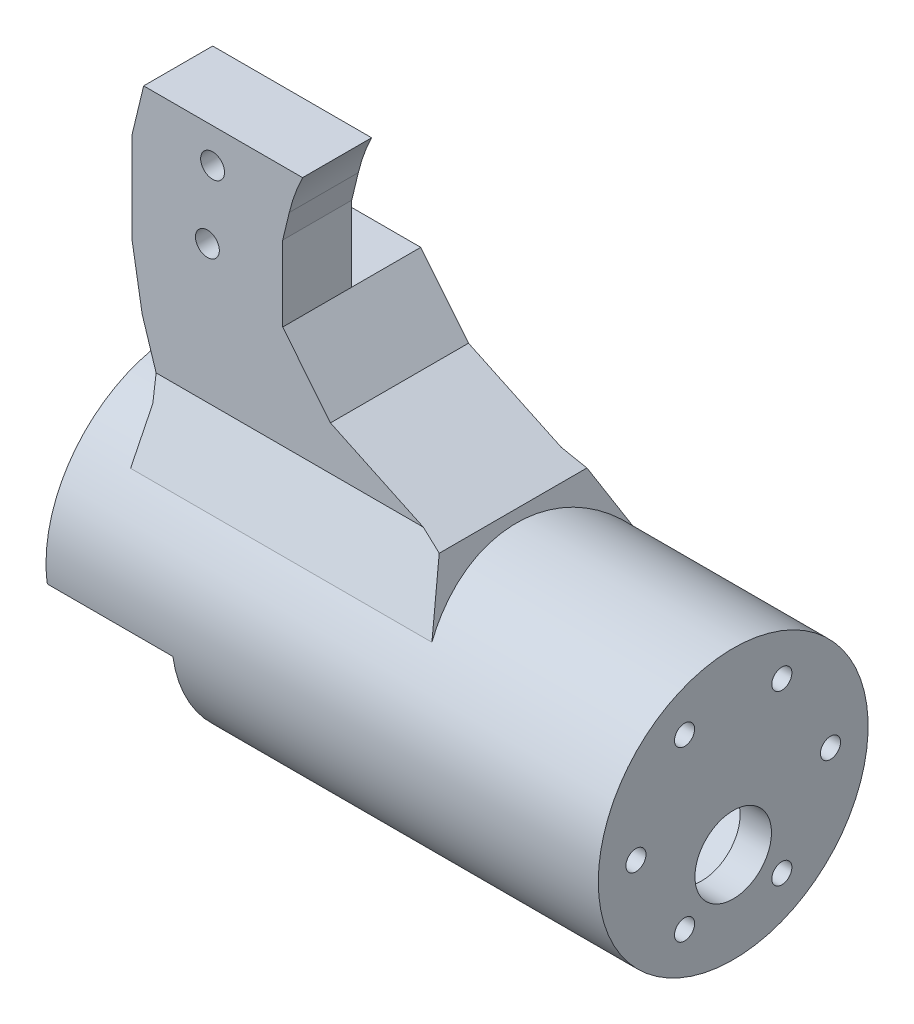
ISO-10303-21;
HEADER;
FILE_DESCRIPTION(('STEP AP214'),'2;1');
FILE_NAME('part.step','',(''),(''),'','','');
FILE_SCHEMA(('AUTOMOTIVE_DESIGN { 1 0 10303 214 1 1 1 1 }'));
ENDSEC;
DATA;
#1=APPLICATION_CONTEXT('core data for automotive mechanical design processes');
#2=APPLICATION_PROTOCOL_DEFINITION('international standard','automotive_design',2000,#1);
#3=PRODUCT_CONTEXT('',#1,'mechanical');
#4=PRODUCT('Part','Part','',(#3));
#5=PRODUCT_RELATED_PRODUCT_CATEGORY('part','',(#4));
#6=PRODUCT_DEFINITION_FORMATION('','',#4);
#7=PRODUCT_DEFINITION_CONTEXT('part definition',#1,'design');
#8=PRODUCT_DEFINITION('design','',#6,#7);
#9=PRODUCT_DEFINITION_SHAPE('','',#8);
#10=(LENGTH_UNIT() NAMED_UNIT(*) SI_UNIT(.MILLI.,.METRE.));
#11=(NAMED_UNIT(*) PLANE_ANGLE_UNIT() SI_UNIT($,.RADIAN.));
#12=(NAMED_UNIT(*) SI_UNIT($,.STERADIAN.) SOLID_ANGLE_UNIT());
#13=UNCERTAINTY_MEASURE_WITH_UNIT(LENGTH_MEASURE(1.E-05),#10,'distance_accuracy_value','');
#14=(GEOMETRIC_REPRESENTATION_CONTEXT(3) GLOBAL_UNCERTAINTY_ASSIGNED_CONTEXT((#13)) GLOBAL_UNIT_ASSIGNED_CONTEXT((#10,
#11,#12)) REPRESENTATION_CONTEXT('',''));
#15=CARTESIAN_POINT('',(0.,0.,0.));
#16=DIRECTION('',(0.,0.,1.));
#17=DIRECTION('',(1.,0.,0.));
#18=AXIS2_PLACEMENT_3D('',#15,#16,#17);
#19=CARTESIAN_POINT('',(-98.,-78.,0.));
#20=DIRECTION('',(-1.,0.,0.));
#21=DIRECTION('',(0.,0.,1.));
#22=AXIS2_PLACEMENT_3D('',#19,#20,#21);
#23=CYLINDRICAL_SURFACE('',#22,21.5);
#24=DIRECTION('',(-1.,0.,0.));
#25=VECTOR('',#24,1.);
#26=CARTESIAN_POINT('',(-78.,-81.,-21.2896688560438));
#27=LINE('',#26,#25);
#28=CARTESIAN_POINT('',(-78.,-81.,-21.2896688560438));
#29=VERTEX_POINT('',#28);
#30=CARTESIAN_POINT('',(-98.,-81.,-21.2896688560438));
#31=VERTEX_POINT('',#30);
#32=EDGE_CURVE('E384',#29,#31,#27,.T.);
#33=ORIENTED_EDGE('',*,*,#32,.T.);
#34=CARTESIAN_POINT('',(-98.,-78.,0.));
#35=DIRECTION('',(-1.,0.,0.));
#36=DIRECTION('',(0.,0.,1.));
#37=AXIS2_PLACEMENT_3D('',#34,#35,#36);
#38=CIRCLE('',#37,21.5);
#39=CARTESIAN_POINT('',(-98.,-81.,21.2896688560438));
#40=VERTEX_POINT('',#39);
#41=EDGE_CURVE('E443',#40,#31,#38,.T.);
#42=ORIENTED_EDGE('',*,*,#41,.F.);
#43=DIRECTION('',(-1.,0.,0.));
#44=VECTOR('',#43,1.);
#45=CARTESIAN_POINT('',(-78.,-81.,21.2896688560438));
#46=LINE('',#45,#44);
#47=CARTESIAN_POINT('',(-78.,-81.,21.2896688560438));
#48=VERTEX_POINT('',#47);
#49=EDGE_CURVE('E382',#48,#40,#46,.T.);
#50=ORIENTED_EDGE('',*,*,#49,.F.);
#51=CARTESIAN_POINT('',(-78.,-78.,0.));
#52=DIRECTION('',(-1.,0.,0.));
#53=DIRECTION('',(0.,0.,1.));
#54=AXIS2_PLACEMENT_3D('',#51,#52,#53);
#55=CIRCLE('',#54,21.5);
#56=EDGE_CURVE('E376',#29,#48,#55,.T.);
#57=ORIENTED_EDGE('',*,*,#56,.F.);
#58=EDGE_LOOP('',(#33,#42,#50,#57));
#59=FACE_BOUND('',#58,.T.);
#60=CARTESIAN_POINT('',(-10.,-78.,0.));
#61=DIRECTION('',(-1.,0.,0.));
#62=DIRECTION('',(0.,0.,1.));
#63=AXIS2_PLACEMENT_3D('',#60,#61,#62);
#64=CIRCLE('',#63,21.5);
#65=CARTESIAN_POINT('',(-10.,-78.,21.5));
#66=VERTEX_POINT('',#65);
#67=EDGE_CURVE('E439',#66,#66,#64,.T.);
#68=ORIENTED_EDGE('',*,*,#67,.T.);
#69=EDGE_LOOP('',(#68));
#70=FACE_BOUND('',#69,.T.);
#71=CARTESIAN_POINT('',(-89.9999999999999,-78.,0.));
#72=DIRECTION('',(1.,0.,0.));
#73=DIRECTION('',(0.,0.,-1.));
#74=AXIS2_PLACEMENT_3D('',#71,#72,#73);
#75=CIRCLE('',#74,21.5);
#76=CARTESIAN_POINT('',(-89.9999999999999,-63.6659651546941,-16.0245263597261));
#77=VERTEX_POINT('',#76);
#78=CARTESIAN_POINT('',(-89.9999999999999,-56.5,0.));
#79=VERTEX_POINT('',#78);
#80=EDGE_CURVE('E437',#77,#79,#75,.T.);
#81=ORIENTED_EDGE('',*,*,#80,.F.);
#82=DIRECTION('',(-1.,0.,0.));
#83=VECTOR('',#82,1.);
#84=CARTESIAN_POINT('',(-98.,-63.6659651546941,-16.0245263597261));
#85=LINE('',#84,#83);
#86=CARTESIAN_POINT('',(-41.9999999999999,-63.6659651546941,-16.0245263597261));
#87=VERTEX_POINT('',#86);
#88=EDGE_CURVE('E270',#77,#87,#85,.F.);
#89=ORIENTED_EDGE('',*,*,#88,.T.);
#90=CARTESIAN_POINT('',(-41.9999999999999,-78.,0.));
#91=DIRECTION('',(-1.,0.,0.));
#92=DIRECTION('',(0.,0.,1.));
#93=AXIS2_PLACEMENT_3D('',#90,#91,#92);
#94=CIRCLE('',#93,21.5);
#95=CARTESIAN_POINT('',(-41.9999999999999,-63.6237034803313,-15.9866224818928));
#96=VERTEX_POINT('',#95);
#97=EDGE_CURVE('E434',#96,#87,#94,.T.);
#98=ORIENTED_EDGE('',*,*,#97,.F.);
#99=CARTESIAN_POINT('',(-36.8457764217381,-78.,0.));
#100=DIRECTION('',(0.941329900196425,0.337487805699981,0.));
#101=DIRECTION('',(-0.337487805699981,0.941329900196425,0.));
#102=AXIS2_PLACEMENT_3D('',#99,#100,#101);
#103=ELLIPSE('',#102,22.84002664264,21.5);
#104=CARTESIAN_POINT('',(-41.9999999999999,-63.6237034803313,15.9866224818928));
#105=VERTEX_POINT('',#104);
#106=EDGE_CURVE('E11',#96,#105,#103,.T.);
#107=ORIENTED_EDGE('',*,*,#106,.T.);
#108=CARTESIAN_POINT('',(-41.9999999999999,-78.,0.));
#109=DIRECTION('',(-1.,0.,0.));
#110=DIRECTION('',(0.,0.,1.));
#111=AXIS2_PLACEMENT_3D('',#108,#109,#110);
#112=CIRCLE('',#111,21.5);
#113=CARTESIAN_POINT('',(-41.9999999999999,-63.6659651546941,16.0245263597261));
#114=VERTEX_POINT('',#113);
#115=EDGE_CURVE('E219',#114,#105,#112,.T.);
#116=ORIENTED_EDGE('',*,*,#115,.F.);
#117=DIRECTION('',(-1.,0.,0.));
#118=VECTOR('',#117,1.);
#119=CARTESIAN_POINT('',(-98.,-63.6659651546941,16.0245263597261));
#120=LINE('',#119,#118);
#121=CARTESIAN_POINT('',(-89.9999999999999,-63.6659651546941,16.0245263597261));
#122=VERTEX_POINT('',#121);
#123=EDGE_CURVE('E267',#114,#122,#120,.T.);
#124=ORIENTED_EDGE('',*,*,#123,.T.);
#125=CARTESIAN_POINT('',(-89.9999999999999,-78.,0.));
#126=DIRECTION('',(1.,0.,0.));
#127=DIRECTION('',(0.,0.,-1.));
#128=AXIS2_PLACEMENT_3D('',#125,#126,#127);
#129=CIRCLE('',#128,21.5);
#130=EDGE_CURVE('E223',#79,#122,#129,.T.);
#131=ORIENTED_EDGE('',*,*,#130,.F.);
#132=EDGE_LOOP('',(#81,#89,#98,#107,#116,#124,#131));
#133=FACE_BOUND('',#132,.T.);
#134=ADVANCED_FACE('F36',(#59,#70,#133),#23,.T.);
#135=CARTESIAN_POINT('',(-84.4134977836509,20.4073121545932,11.));
#136=DIRECTION('',(0.971999047761115,-0.234984789191737,0.));
#137=DIRECTION('',(0.234984789191737,0.971999047761115,0.));
#138=AXIS2_PLACEMENT_3D('',#135,#136,#137);
#139=PLANE('',#138);
#140=DIRECTION('',(0.,0.,-1.));
#141=VECTOR('',#140,1.);
#142=CARTESIAN_POINT('',(-92.9418253522619,-14.8695511019509,11.));
#143=LINE('',#142,#141);
#144=CARTESIAN_POINT('',(-92.9418253522619,-14.8695511019509,11.));
#145=VERTEX_POINT('',#144);
#146=CARTESIAN_POINT('',(-92.9418253522619,-14.8695511019509,0.));
#147=VERTEX_POINT('',#146);
#148=EDGE_CURVE('E254',#145,#147,#143,.T.);
#149=ORIENTED_EDGE('',*,*,#148,.T.);
#150=DIRECTION('',(0.234984789191737,0.971999047761115,0.));
#151=VECTOR('',#150,1.);
#152=CARTESIAN_POINT('',(-86.3740581264236,12.2975838917211,0.));
#153=LINE('',#152,#151);
#154=CARTESIAN_POINT('',(-94.78651792668,-22.5,0.));
#155=VERTEX_POINT('',#154);
#156=EDGE_CURVE('E371',#155,#147,#153,.T.);
#157=ORIENTED_EDGE('',*,*,#156,.F.);
#158=DIRECTION('',(0.,0.,-1.));
#159=VECTOR('',#158,1.);
#160=CARTESIAN_POINT('',(-94.78651792668,-22.5,11.));
#161=LINE('',#160,#159);
#162=CARTESIAN_POINT('',(-94.78651792668,-22.5,11.));
#163=VERTEX_POINT('',#162);
#164=EDGE_CURVE('E251',#163,#155,#161,.T.);
#165=ORIENTED_EDGE('',*,*,#164,.F.);
#166=DIRECTION('',(-0.234984789191737,-0.971999047761115,0.));
#167=VECTOR('',#166,1.);
#168=CARTESIAN_POINT('',(-84.4134977836509,20.4073121545932,11.));
#169=LINE('',#168,#167);
#170=EDGE_CURVE('E232',#145,#163,#169,.T.);
#171=ORIENTED_EDGE('',*,*,#170,.F.);
#172=EDGE_LOOP('',(#149,#157,#165,#171));
#173=FACE_BOUND('',#172,.T.);
#174=ADVANCED_FACE('F475',(#173),#139,.F.);
#175=CARTESIAN_POINT('',(-94.78651792668,0.,11.));
#176=DIRECTION('',(1.,0.,0.));
#177=DIRECTION('',(0.,0.,-1.));
#178=AXIS2_PLACEMENT_3D('',#175,#176,#177);
#179=PLANE('',#178);
#180=ORIENTED_EDGE('',*,*,#164,.T.);
#181=DIRECTION('',(0.,1.,0.));
#182=VECTOR('',#181,1.);
#183=CARTESIAN_POINT('',(-94.78651792668,-14.8695511019509,0.));
#184=LINE('',#183,#182);
#185=CARTESIAN_POINT('',(-94.78651792668,-37.0753078944646,0.));
#186=VERTEX_POINT('',#185);
#187=EDGE_CURVE('E358',#186,#155,#184,.T.);
#188=ORIENTED_EDGE('',*,*,#187,.F.);
#189=DIRECTION('',(0.,0.,-1.));
#190=VECTOR('',#189,1.);
#191=CARTESIAN_POINT('',(-94.78651792668,-37.0753078944646,11.));
#192=LINE('',#191,#190);
#193=CARTESIAN_POINT('',(-94.78651792668,-37.0753078944646,11.));
#194=VERTEX_POINT('',#193);
#195=EDGE_CURVE('E210',#194,#186,#192,.T.);
#196=ORIENTED_EDGE('',*,*,#195,.F.);
#197=DIRECTION('',(0.,-1.,0.));
#198=VECTOR('',#197,1.);
#199=CARTESIAN_POINT('',(-94.78651792668,0.,11.));
#200=LINE('',#199,#198);
#201=EDGE_CURVE('E448',#163,#194,#200,.T.);
#202=ORIENTED_EDGE('',*,*,#201,.F.);
#203=EDGE_LOOP('',(#180,#188,#196,#202));
#204=FACE_BOUND('',#203,.T.);
#205=ADVANCED_FACE('F481',(#204),#179,.F.);
#206=CARTESIAN_POINT('',(-98.2522414229531,-16.7686112099551,11.));
#207=DIRECTION('',(0.985746679262421,0.168236394169368,0.));
#208=DIRECTION('',(-0.168236394169368,0.985746679262421,0.));
#209=AXIS2_PLACEMENT_3D('',#206,#207,#208);
#210=PLANE('',#209);
#211=DIRECTION('',(0.168236394169368,-0.98574667926242,0.));
#212=VECTOR('',#211,1.);
#213=CARTESIAN_POINT('',(-98.2522414229531,-16.7686112099551,-11.));
#214=LINE('',#213,#212);
#215=CARTESIAN_POINT('',(-94.78651792668,-37.0753078944646,-11.));
#216=VERTEX_POINT('',#215);
#217=CARTESIAN_POINT('',(-93.1780152054959,-46.5,-11.));
#218=VERTEX_POINT('',#217);
#219=EDGE_CURVE('E206',#216,#218,#214,.T.);
#220=ORIENTED_EDGE('',*,*,#219,.T.);
#221=DIRECTION('',(0.,0.,-1.));
#222=VECTOR('',#221,1.);
#223=CARTESIAN_POINT('',(-93.1780152054959,-46.5,11.));
#224=LINE('',#223,#222);
#225=CARTESIAN_POINT('',(-93.1780152054959,-46.5,11.));
#226=VERTEX_POINT('',#225);
#227=EDGE_CURVE('E248',#226,#218,#224,.T.);
#228=ORIENTED_EDGE('',*,*,#227,.F.);
#229=DIRECTION('',(0.168236394169368,-0.98574667926242,0.));
#230=VECTOR('',#229,1.);
#231=CARTESIAN_POINT('',(-98.2522414229531,-16.7686112099551,11.));
#232=LINE('',#231,#230);
#233=EDGE_CURVE('E337',#194,#226,#232,.T.);
#234=ORIENTED_EDGE('',*,*,#233,.F.);
#235=ORIENTED_EDGE('',*,*,#195,.T.);
#236=DIRECTION('',(0.,0.,1.));
#237=VECTOR('',#236,1.);
#238=CARTESIAN_POINT('',(-94.78651792668,-37.0753078944646,0.));
#239=LINE('',#238,#237);
#240=EDGE_CURVE('E192',#216,#186,#239,.T.);
#241=ORIENTED_EDGE('',*,*,#240,.F.);
#242=EDGE_LOOP('',(#220,#228,#234,#235,#241));
#243=FACE_BOUND('',#242,.T.);
#244=ADVANCED_FACE('F204',(#243),#210,.F.);
#245=CARTESIAN_POINT('',(-98.0526802844433,-31.161290888359,11.));
#246=DIRECTION('',(0.95303044179833,0.302874523533558,0.));
#247=DIRECTION('',(-0.302874523533558,0.95303044179833,0.));
#248=AXIS2_PLACEMENT_3D('',#245,#246,#247);
#249=PLANE('',#248);
#250=DIRECTION('',(0.302874523533558,-0.95303044179833,0.));
#251=VECTOR('',#250,1.);
#252=CARTESIAN_POINT('',(-98.0526802844433,-31.161290888359,-11.));
#253=LINE('',#252,#251);
#254=CARTESIAN_POINT('',(-90.9570827398739,-53.4884261780158,-11.));
#255=VERTEX_POINT('',#254);
#256=EDGE_CURVE('E218',#218,#255,#253,.T.);
#257=ORIENTED_EDGE('',*,*,#256,.T.);
#258=DIRECTION('',(0.274055906121888,-0.862349260154413,-0.425731269500898));
#259=VECTOR('',#258,1.);
#260=CARTESIAN_POINT('',(-99.3334554227896,-27.1311807235888,2.01224931282567));
#261=LINE('',#260,#259);
#262=CARTESIAN_POINT('',(-89.9999999999999,-56.5,-12.4867771165009));
#263=VERTEX_POINT('',#262);
#264=EDGE_CURVE('E276',#255,#263,#261,.T.);
#265=ORIENTED_EDGE('',*,*,#264,.T.);
#266=DIRECTION('',(0.,0.,-1.));
#267=VECTOR('',#266,1.);
#268=CARTESIAN_POINT('',(-89.9999999999999,-56.5,11.));
#269=LINE('',#268,#267);
#270=EDGE_CURVE('E244',#79,#263,#269,.T.);
#271=ORIENTED_EDGE('',*,*,#270,.F.);
#272=CARTESIAN_POINT('',(-89.9999999999999,-56.5,12.4867771165009));
#273=VERTEX_POINT('',#272);
#274=EDGE_CURVE('E245',#273,#79,#269,.T.);
#275=ORIENTED_EDGE('',*,*,#274,.F.);
#276=DIRECTION('',(0.274055906121888,-0.862349260154413,0.425731269500898));
#277=VECTOR('',#276,1.);
#278=CARTESIAN_POINT('',(-96.7666237085848,-35.2080197197202,1.97518719145296));
#279=LINE('',#278,#277);
#280=CARTESIAN_POINT('',(-90.9570827398739,-53.4884261780158,11.));
#281=VERTEX_POINT('',#280);
#282=EDGE_CURVE('E295',#273,#281,#279,.F.);
#283=ORIENTED_EDGE('',*,*,#282,.T.);
#284=DIRECTION('',(0.302874523533558,-0.95303044179833,0.));
#285=VECTOR('',#284,1.);
#286=CARTESIAN_POINT('',(-98.0526802844433,-31.161290888359,11.));
#287=LINE('',#286,#285);
#288=EDGE_CURVE('E333',#226,#281,#287,.T.);
#289=ORIENTED_EDGE('',*,*,#288,.F.);
#290=ORIENTED_EDGE('',*,*,#227,.T.);
#291=EDGE_LOOP('',(#257,#265,#271,#275,#283,#289,#290));
#292=FACE_BOUND('',#291,.T.);
#293=ADVANCED_FACE('F452',(#292),#249,.F.);
#294=CARTESIAN_POINT('',(-29.471892703518,-62.4156191809848,11.));
#295=DIRECTION('',(0.42698083978432,0.904260671740775,0.));
#296=DIRECTION('',(-0.904260671740775,0.42698083978432,0.));
#297=AXIS2_PLACEMENT_3D('',#294,#295,#296);
#298=PLANE('',#297);
#299=DIRECTION('',(0.,0.,-1.));
#300=VECTOR('',#299,1.);
#301=CARTESIAN_POINT('',(-45.0744862839186,-55.0482651447333,0.));
#302=LINE('',#301,#300);
#303=CARTESIAN_POINT('',(-45.0744862839186,-55.0482651447333,11.7700733962463));
#304=VERTEX_POINT('',#303);
#305=CARTESIAN_POINT('',(-45.0744862839186,-55.0482651447333,-11.7700733962463));
#306=VERTEX_POINT('',#305);
#307=EDGE_CURVE('E297',#304,#306,#302,.T.);
#308=ORIENTED_EDGE('',*,*,#307,.T.);
#309=DIRECTION('',(-0.884816093206045,0.417799347398913,0.206262421484465));
#310=VECTOR('',#309,1.);
#311=CARTESIAN_POINT('',(-87.2270216026564,-35.1443530407328,-1.94375573169227));
#312=LINE('',#311,#310);
#313=CARTESIAN_POINT('',(-48.3779156194455,-53.4884261780158,-11.));
#314=VERTEX_POINT('',#313);
#315=EDGE_CURVE('E285',#306,#314,#312,.T.);
#316=ORIENTED_EDGE('',*,*,#315,.T.);
#317=DIRECTION('',(0.904260671740775,-0.42698083978432,0.));
#318=VECTOR('',#317,1.);
#319=CARTESIAN_POINT('',(-29.471892703518,-62.4156191809848,-11.));
#320=LINE('',#319,#318);
#321=CARTESIAN_POINT('',(-63.1780152054959,-46.5,-11.));
#322=VERTEX_POINT('',#321);
#323=EDGE_CURVE('E221',#322,#314,#320,.T.);
#324=ORIENTED_EDGE('',*,*,#323,.F.);
#325=DIRECTION('',(0.,0.,-1.));
#326=VECTOR('',#325,1.);
#327=CARTESIAN_POINT('',(-63.1780152054959,-46.5,11.));
#328=LINE('',#327,#326);
#329=CARTESIAN_POINT('',(-63.1780152054959,-46.5,11.));
#330=VERTEX_POINT('',#329);
#331=EDGE_CURVE('E242',#330,#322,#328,.T.);
#332=ORIENTED_EDGE('',*,*,#331,.F.);
#333=DIRECTION('',(0.904260671740775,-0.42698083978432,0.));
#334=VECTOR('',#333,1.);
#335=CARTESIAN_POINT('',(-29.471892703518,-62.4156191809848,11.));
#336=LINE('',#335,#334);
#337=CARTESIAN_POINT('',(-48.3779156194455,-53.4884261780158,11.));
#338=VERTEX_POINT('',#337);
#339=EDGE_CURVE('E315',#330,#338,#336,.T.);
#340=ORIENTED_EDGE('',*,*,#339,.T.);
#341=DIRECTION('',(-0.884816093206045,0.417799347398913,-0.206262421484465));
#342=VECTOR('',#341,1.);
#343=CARTESIAN_POINT('',(-87.2270216026564,-35.1443530407328,1.94375573169227));
#344=LINE('',#343,#342);
#345=EDGE_CURVE('E287',#338,#304,#344,.F.);
#346=ORIENTED_EDGE('',*,*,#345,.T.);
#347=EDGE_LOOP('',(#308,#316,#324,#332,#340,#346));
#348=FACE_BOUND('',#347,.T.);
#349=ADVANCED_FACE('F312',(#348),#298,.T.);
#350=CARTESIAN_POINT('',(-60.9770040591636,-49.2264040160328,11.));
#351=DIRECTION('',(0.778092434340065,0.628149793936726,0.));
#352=DIRECTION('',(-0.628149793936726,0.778092434340065,0.));
#353=AXIS2_PLACEMENT_3D('',#350,#351,#352);
#354=PLANE('',#353);
#355=DIRECTION('',(0.628149793936726,-0.778092434340065,0.));
#356=VECTOR('',#355,1.);
#357=CARTESIAN_POINT('',(-60.9770040591636,-49.2264040160328,-11.));
#358=LINE('',#357,#356);
#359=CARTESIAN_POINT('',(-70.78651792668,-37.0753078944646,-11.));
#360=VERTEX_POINT('',#359);
#361=EDGE_CURVE('E230',#360,#322,#358,.T.);
#362=ORIENTED_EDGE('',*,*,#361,.F.);
#363=DIRECTION('',(0.,0.,1.));
#364=VECTOR('',#363,1.);
#365=CARTESIAN_POINT('',(-70.78651792668,-37.0753078944646,0.));
#366=LINE('',#365,#364);
#367=CARTESIAN_POINT('',(-70.78651792668,-37.0753078944646,0.));
#368=VERTEX_POINT('',#367);
#369=EDGE_CURVE('E195',#360,#368,#366,.T.);
#370=ORIENTED_EDGE('',*,*,#369,.T.);
#371=DIRECTION('',(0.,0.,-1.));
#372=VECTOR('',#371,1.);
#373=CARTESIAN_POINT('',(-70.78651792668,-37.0753078944646,11.));
#374=LINE('',#373,#372);
#375=CARTESIAN_POINT('',(-70.78651792668,-37.0753078944646,11.));
#376=VERTEX_POINT('',#375);
#377=EDGE_CURVE('E239',#376,#368,#374,.T.);
#378=ORIENTED_EDGE('',*,*,#377,.F.);
#379=DIRECTION('',(0.628149793936726,-0.778092434340065,0.));
#380=VECTOR('',#379,1.);
#381=CARTESIAN_POINT('',(-60.9770040591636,-49.2264040160328,11.));
#382=LINE('',#381,#380);
#383=EDGE_CURVE('E327',#376,#330,#382,.T.);
#384=ORIENTED_EDGE('',*,*,#383,.T.);
#385=ORIENTED_EDGE('',*,*,#331,.T.);
#386=EDGE_LOOP('',(#362,#370,#378,#384,#385));
#387=FACE_BOUND('',#386,.T.);
#388=ADVANCED_FACE('F324',(#387),#354,.T.);
#389=CARTESIAN_POINT('',(-70.7865179266799,0.,11.));
#390=DIRECTION('',(1.,0.,0.));
#391=DIRECTION('',(0.,1.,0.));
#392=AXIS2_PLACEMENT_3D('',#389,#390,#391);
#393=PLANE('',#392);
#394=DIRECTION('',(0.,1.,0.));
#395=VECTOR('',#394,1.);
#396=CARTESIAN_POINT('',(-70.7865179266799,-14.8695511019508,0.));
#397=LINE('',#396,#395);
#398=CARTESIAN_POINT('',(-70.78651792668,-25.0753078944646,0.));
#399=VERTEX_POINT('',#398);
#400=EDGE_CURVE('E361',#368,#399,#397,.T.);
#401=ORIENTED_EDGE('',*,*,#400,.T.);
#402=DIRECTION('',(0.,0.,-1.));
#403=VECTOR('',#402,1.);
#404=CARTESIAN_POINT('',(-70.78651792668,-25.0753078944646,11.));
#405=LINE('',#404,#403);
#406=CARTESIAN_POINT('',(-70.78651792668,-25.0753078944646,11.));
#407=VERTEX_POINT('',#406);
#408=EDGE_CURVE('E236',#407,#399,#405,.T.);
#409=ORIENTED_EDGE('',*,*,#408,.F.);
#410=DIRECTION('',(0.,-1.,0.));
#411=VECTOR('',#410,1.);
#412=CARTESIAN_POINT('',(-70.7865179266799,0.,11.));
#413=LINE('',#412,#411);
#414=EDGE_CURVE('E335',#407,#376,#413,.T.);
#415=ORIENTED_EDGE('',*,*,#414,.T.);
#416=ORIENTED_EDGE('',*,*,#377,.T.);
#417=EDGE_LOOP('',(#401,#409,#415,#416));
#418=FACE_BOUND('',#417,.T.);
#419=ADVANCED_FACE('F578',(#418),#393,.T.);
#420=CARTESIAN_POINT('',(-61.1505130339722,14.7833893946223,11.));
#421=DIRECTION('',(0.971999047761115,-0.234984789191738,0.));
#422=DIRECTION('',(0.234984789191738,0.971999047761115,0.));
#423=AXIS2_PLACEMENT_3D('',#420,#421,#422);
#424=PLANE('',#423);
#425=DIRECTION('',(0.234984789191738,0.971999047761115,0.));
#426=VECTOR('',#425,1.);
#427=CARTESIAN_POINT('',(-63.1110733767449,6.67366113175022,0.));
#428=LINE('',#427,#426);
#429=CARTESIAN_POINT('',(-69.738862808107,-20.7417517475428,0.));
#430=VERTEX_POINT('',#429);
#431=EDGE_CURVE('E368',#399,#430,#428,.T.);
#432=ORIENTED_EDGE('',*,*,#431,.T.);
#433=DIRECTION('',(0.,0.,-1.));
#434=VECTOR('',#433,1.);
#435=CARTESIAN_POINT('',(-69.738862808107,-20.7417517475428,11.));
#436=LINE('',#435,#434);
#437=CARTESIAN_POINT('',(-69.738862808107,-20.7417517475428,11.));
#438=VERTEX_POINT('',#437);
#439=EDGE_CURVE('E233',#438,#430,#436,.T.);
#440=ORIENTED_EDGE('',*,*,#439,.F.);
#441=DIRECTION('',(-0.234984789191738,-0.971999047761115,0.));
#442=VECTOR('',#441,1.);
#443=CARTESIAN_POINT('',(-61.1505130339722,14.7833893946223,11.));
#444=LINE('',#443,#442);
#445=EDGE_CURVE('E341',#438,#407,#444,.T.);
#446=ORIENTED_EDGE('',*,*,#445,.T.);
#447=ORIENTED_EDGE('',*,*,#408,.T.);
#448=EDGE_LOOP('',(#432,#440,#446,#447));
#449=FACE_BOUND('',#448,.T.);
#450=ADVANCED_FACE('F580',(#449),#424,.T.);
#451=CARTESIAN_POINT('',(-41.8993681465749,-27.4720647034176,11.));
#452=DIRECTION('',(0.,0.,-1.));
#453=DIRECTION('',(-1.,0.,0.));
#454=AXIS2_PLACEMENT_3D('',#451,#452,#453);
#455=CYLINDRICAL_SURFACE('',#454,28.6414834722905);
#456=CARTESIAN_POINT('',(-41.8993681465749,-27.4720647034176,0.));
#457=DIRECTION('',(0.,0.,1.));
#458=DIRECTION('',(1.,0.,0.));
#459=AXIS2_PLACEMENT_3D('',#456,#457,#458);
#460=CIRCLE('',#459,28.6414834722905);
#461=CARTESIAN_POINT('',(-67.6192286908768,-14.8695511019509,0.));
#462=VERTEX_POINT('',#461);
#463=EDGE_CURVE('E211',#462,#430,#460,.T.);
#464=ORIENTED_EDGE('',*,*,#463,.F.);
#465=DIRECTION('',(0.,0.,-1.));
#466=VECTOR('',#465,1.);
#467=CARTESIAN_POINT('',(-67.6192286908768,-14.8695511019509,11.));
#468=LINE('',#467,#466);
#469=CARTESIAN_POINT('',(-67.6192286908768,-14.8695511019509,11.));
#470=VERTEX_POINT('',#469);
#471=EDGE_CURVE('E355',#470,#462,#468,.T.);
#472=ORIENTED_EDGE('',*,*,#471,.F.);
#473=CARTESIAN_POINT('',(-41.8993681465749,-27.4720647034176,11.));
#474=DIRECTION('',(0.,0.,1.));
#475=DIRECTION('',(1.,0.,0.));
#476=AXIS2_PLACEMENT_3D('',#473,#474,#475);
#477=CIRCLE('',#476,28.6414834722905);
#478=EDGE_CURVE('E226',#438,#470,#477,.F.);
#479=ORIENTED_EDGE('',*,*,#478,.F.);
#480=ORIENTED_EDGE('',*,*,#439,.T.);
#481=EDGE_LOOP('',(#464,#472,#479,#480));
#482=FACE_BOUND('',#481,.T.);
#483=ADVANCED_FACE('F353',(#482),#455,.F.);
#484=CARTESIAN_POINT('',(0.,0.,11.));
#485=DIRECTION('',(0.,0.,1.));
#486=DIRECTION('',(1.,0.,0.));
#487=AXIS2_PLACEMENT_3D('',#484,#485,#486);
#488=PLANE('',#487);
#489=CARTESIAN_POINT('',(-81.960177429347,-20.3695511019509,11.));
#490=DIRECTION('',(0.,0.,1.));
#491=DIRECTION('',(1.,0.,0.));
#492=AXIS2_PLACEMENT_3D('',#489,#490,#491);
#493=CIRCLE('',#492,1.9);
#494=CARTESIAN_POINT('',(-80.060177429347,-20.3695511019509,11.));
#495=VERTEX_POINT('',#494);
#496=EDGE_CURVE('E563',#495,#495,#493,.T.);
#497=ORIENTED_EDGE('',*,*,#496,.F.);
#498=EDGE_LOOP('',(#497));
#499=FACE_BOUND('',#498,.T.);
#500=CARTESIAN_POINT('',(-82.78651792668,-31.5753078944646,11.));
#501=DIRECTION('',(0.,0.,1.));
#502=DIRECTION('',(1.,0.,0.));
#503=AXIS2_PLACEMENT_3D('',#500,#501,#502);
#504=CIRCLE('',#503,1.9);
#505=CARTESIAN_POINT('',(-80.88651792668,-31.5753078944646,11.));
#506=VERTEX_POINT('',#505);
#507=EDGE_CURVE('E567',#506,#506,#504,.T.);
#508=ORIENTED_EDGE('',*,*,#507,.F.);
#509=EDGE_LOOP('',(#508));
#510=FACE_BOUND('',#509,.T.);
#511=ORIENTED_EDGE('',*,*,#288,.T.);
#512=DIRECTION('',(1.,0.,0.));
#513=VECTOR('',#512,1.);
#514=CARTESIAN_POINT('',(-41.9999999999999,-53.4884261780158,11.));
#515=LINE('',#514,#513);
#516=EDGE_CURVE('E273',#281,#338,#515,.T.);
#517=ORIENTED_EDGE('',*,*,#516,.T.);
#518=ORIENTED_EDGE('',*,*,#339,.F.);
#519=ORIENTED_EDGE('',*,*,#383,.F.);
#520=ORIENTED_EDGE('',*,*,#414,.F.);
#521=ORIENTED_EDGE('',*,*,#445,.F.);
#522=ORIENTED_EDGE('',*,*,#478,.T.);
#523=DIRECTION('',(-1.,0.,0.));
#524=VECTOR('',#523,1.);
#525=CARTESIAN_POINT('',(26.001,-14.8695511019509,11.));
#526=LINE('',#525,#524);
#527=EDGE_CURVE('E348',#470,#145,#526,.T.);
#528=ORIENTED_EDGE('',*,*,#527,.T.);
#529=ORIENTED_EDGE('',*,*,#170,.T.);
#530=ORIENTED_EDGE('',*,*,#201,.T.);
#531=ORIENTED_EDGE('',*,*,#233,.T.);
#532=EDGE_LOOP('',(#511,#517,#518,#519,#520,#521,#522,#528,#529,#530,#531));
#533=FACE_BOUND('',#532,.T.);
#534=ADVANCED_FACE('F330',(#499,#510,#533),#488,.T.);
#535=CARTESIAN_POINT('',(0.,0.,-11.));
#536=DIRECTION('',(0.,0.,1.));
#537=DIRECTION('',(1.,0.,0.));
#538=AXIS2_PLACEMENT_3D('',#535,#536,#537);
#539=PLANE('',#538);
#540=ORIENTED_EDGE('',*,*,#323,.T.);
#541=DIRECTION('',(-1.,0.,0.));
#542=VECTOR('',#541,1.);
#543=CARTESIAN_POINT('',(0.,-53.4884261780158,-11.));
#544=LINE('',#543,#542);
#545=EDGE_CURVE('E265',#314,#255,#544,.T.);
#546=ORIENTED_EDGE('',*,*,#545,.T.);
#547=ORIENTED_EDGE('',*,*,#256,.F.);
#548=ORIENTED_EDGE('',*,*,#219,.F.);
#549=DIRECTION('',(-1.,0.,0.));
#550=VECTOR('',#549,1.);
#551=CARTESIAN_POINT('',(26.001,-37.0753078944646,-11.));
#552=LINE('',#551,#550);
#553=EDGE_CURVE('E189',#360,#216,#552,.T.);
#554=ORIENTED_EDGE('',*,*,#553,.F.);
#555=ORIENTED_EDGE('',*,*,#361,.T.);
#556=EDGE_LOOP('',(#540,#546,#547,#548,#554,#555));
#557=FACE_BOUND('',#556,.T.);
#558=ADVANCED_FACE('F215',(#557),#539,.F.);
#559=CARTESIAN_POINT('',(-89.9999999999999,-99.502,11.));
#560=DIRECTION('',(1.,0.,0.));
#561=DIRECTION('',(0.,0.,-1.));
#562=AXIS2_PLACEMENT_3D('',#559,#560,#561);
#563=PLANE('',#562);
#564=ORIENTED_EDGE('',*,*,#274,.T.);
#565=ORIENTED_EDGE('',*,*,#130,.T.);
#566=DIRECTION('',(0.,-0.896679754505563,0.442679814154478));
#567=VECTOR('',#566,1.);
#568=CARTESIAN_POINT('',(-89.9999999999999,-90.4849307787501,29.2647212661215));
#569=LINE('',#568,#567);
#570=EDGE_CURVE('E292',#122,#273,#569,.F.);
#571=ORIENTED_EDGE('',*,*,#570,.T.);
#572=EDGE_LOOP('',(#564,#565,#571));
#573=FACE_BOUND('',#572,.T.);
#574=ADVANCED_FACE('F457',(#573),#563,.F.);
#575=CARTESIAN_POINT('',(-41.9999999999999,-99.502,-11.));
#576=DIRECTION('',(-1.,0.,0.));
#577=DIRECTION('',(0.,0.,1.));
#578=AXIS2_PLACEMENT_3D('',#575,#576,#577);
#579=PLANE('',#578);
#580=ORIENTED_EDGE('',*,*,#115,.T.);
#581=DIRECTION('',(0.,0.,1.));
#582=VECTOR('',#581,1.);
#583=CARTESIAN_POINT('',(-41.9999999999999,-63.6237034803313,12.4867771165008));
#584=LINE('',#583,#582);
#585=CARTESIAN_POINT('',(-41.9999999999999,-63.6237034803313,16.0036622886251));
#586=VERTEX_POINT('',#585);
#587=EDGE_CURVE('E57',#105,#586,#584,.T.);
#588=ORIENTED_EDGE('',*,*,#587,.T.);
#589=DIRECTION('',(0.,0.896679754505563,-0.442679814154478));
#590=VECTOR('',#589,1.);
#591=CARTESIAN_POINT('',(-41.9999999999999,-81.7522061829768,24.953482073205));
#592=LINE('',#591,#590);
#593=EDGE_CURVE('E290',#586,#114,#592,.F.);
#594=ORIENTED_EDGE('',*,*,#593,.T.);
#595=EDGE_LOOP('',(#580,#588,#594));
#596=FACE_BOUND('',#595,.T.);
#597=ADVANCED_FACE('F459',(#596),#579,.F.);
#598=CARTESIAN_POINT('',(-98.,0.,0.));
#599=DIRECTION('',(1.,0.,0.));
#600=DIRECTION('',(0.,0.,-1.));
#601=AXIS2_PLACEMENT_3D('',#598,#599,#600);
#602=PLANE('',#601);
#603=ORIENTED_EDGE('',*,*,#41,.T.);
#604=DIRECTION('',(0.,0.,-1.));
#605=VECTOR('',#604,1.);
#606=CARTESIAN_POINT('',(-98.,-81.,-21.2896688560438));
#607=LINE('',#606,#605);
#608=CARTESIAN_POINT('',(-98.,-81.,-18.356470248934));
#609=VERTEX_POINT('',#608);
#610=EDGE_CURVE('E375',#609,#31,#607,.T.);
#611=ORIENTED_EDGE('',*,*,#610,.F.);
#612=CARTESIAN_POINT('',(-98.,-78.,0.));
#613=DIRECTION('',(-1.,0.,0.));
#614=DIRECTION('',(0.,0.,1.));
#615=AXIS2_PLACEMENT_3D('',#612,#613,#614);
#616=CIRCLE('',#615,18.6);
#617=CARTESIAN_POINT('',(-98.,-81.,18.356470248934));
#618=VERTEX_POINT('',#617);
#619=EDGE_CURVE('E392',#618,#609,#616,.T.);
#620=ORIENTED_EDGE('',*,*,#619,.F.);
#621=EDGE_CURVE('E379',#40,#618,#607,.T.);
#622=ORIENTED_EDGE('',*,*,#621,.F.);
#623=EDGE_LOOP('',(#603,#611,#620,#622));
#624=FACE_BOUND('',#623,.T.);
#625=ADVANCED_FACE('F461',(#624),#602,.F.);
#626=CARTESIAN_POINT('',(-10.,0.,0.));
#627=DIRECTION('',(1.,0.,0.));
#628=DIRECTION('',(0.,0.,-1.));
#629=AXIS2_PLACEMENT_3D('',#626,#627,#628);
#630=PLANE('',#629);
#631=CARTESIAN_POINT('',(-10.,-78.,-15.5));
#632=DIRECTION('',(1.,0.,0.));
#633=DIRECTION('',(0.,0.,-1.));
#634=AXIS2_PLACEMENT_3D('',#631,#632,#633);
#635=CIRCLE('',#634,1.60000000000001);
#636=CARTESIAN_POINT('',(-10.,-78.,-17.1));
#637=VERTEX_POINT('',#636);
#638=EDGE_CURVE('E389',#637,#637,#635,.T.);
#639=ORIENTED_EDGE('',*,*,#638,.F.);
#640=EDGE_LOOP('',(#639));
#641=FACE_BOUND('',#640,.T.);
#642=CARTESIAN_POINT('',(-10.,-85.,0.));
#643=DIRECTION('',(1.,0.,0.));
#644=DIRECTION('',(0.,0.,-1.));
#645=AXIS2_PLACEMENT_3D('',#642,#643,#644);
#646=CIRCLE('',#645,6.09999999999999);
#647=CARTESIAN_POINT('',(-10.,-85.,-6.09999999999999));
#648=VERTEX_POINT('',#647);
#649=EDGE_CURVE('E404',#648,#648,#646,.T.);
#650=ORIENTED_EDGE('',*,*,#649,.F.);
#651=EDGE_LOOP('',(#650));
#652=FACE_BOUND('',#651,.T.);
#653=CARTESIAN_POINT('',(-10.,-64.5766062413412,-7.74999999999998));
#654=DIRECTION('',(1.,0.,0.));
#655=DIRECTION('',(0.,0.,-1.));
#656=AXIS2_PLACEMENT_3D('',#653,#654,#655);
#657=CIRCLE('',#656,1.6);
#658=CARTESIAN_POINT('',(-10.,-64.5766062413412,-9.34999999999998));
#659=VERTEX_POINT('',#658);
#660=EDGE_CURVE('E397',#659,#659,#657,.T.);
#661=ORIENTED_EDGE('',*,*,#660,.F.);
#662=EDGE_LOOP('',(#661));
#663=FACE_BOUND('',#662,.T.);
#664=CARTESIAN_POINT('',(-10.,-64.5766062413412,7.75000000000001));
#665=DIRECTION('',(1.,0.,0.));
#666=DIRECTION('',(0.,0.,-1.));
#667=AXIS2_PLACEMENT_3D('',#664,#665,#666);
#668=CIRCLE('',#667,1.6);
#669=CARTESIAN_POINT('',(-10.,-64.5766062413412,6.15));
#670=VERTEX_POINT('',#669);
#671=EDGE_CURVE('E426',#670,#670,#668,.T.);
#672=ORIENTED_EDGE('',*,*,#671,.F.);
#673=EDGE_LOOP('',(#672));
#674=FACE_BOUND('',#673,.T.);
#675=CARTESIAN_POINT('',(-10.,-78.,15.5));
#676=DIRECTION('',(1.,0.,0.));
#677=DIRECTION('',(0.,0.,-1.));
#678=AXIS2_PLACEMENT_3D('',#675,#676,#677);
#679=CIRCLE('',#678,1.6);
#680=CARTESIAN_POINT('',(-10.,-78.,13.9));
#681=VERTEX_POINT('',#680);
#682=EDGE_CURVE('E420',#681,#681,#679,.T.);
#683=ORIENTED_EDGE('',*,*,#682,.F.);
#684=EDGE_LOOP('',(#683));
#685=FACE_BOUND('',#684,.T.);
#686=CARTESIAN_POINT('',(-10.,-91.4233937586588,7.74999999999999));
#687=DIRECTION('',(1.,0.,0.));
#688=DIRECTION('',(0.,0.,-1.));
#689=AXIS2_PLACEMENT_3D('',#686,#687,#688);
#690=CIRCLE('',#689,1.60000000000001);
#691=CARTESIAN_POINT('',(-10.,-91.4233937586588,6.14999999999999));
#692=VERTEX_POINT('',#691);
#693=EDGE_CURVE('E414',#692,#692,#690,.T.);
#694=ORIENTED_EDGE('',*,*,#693,.F.);
#695=EDGE_LOOP('',(#694));
#696=FACE_BOUND('',#695,.T.);
#697=CARTESIAN_POINT('',(-10.,-91.4233937586588,-7.75));
#698=DIRECTION('',(1.,0.,0.));
#699=DIRECTION('',(0.,0.,-1.));
#700=AXIS2_PLACEMENT_3D('',#697,#698,#699);
#701=CIRCLE('',#700,1.6);
#702=CARTESIAN_POINT('',(-10.,-91.4233937586588,-9.35));
#703=VERTEX_POINT('',#702);
#704=EDGE_CURVE('E396',#703,#703,#701,.T.);
#705=ORIENTED_EDGE('',*,*,#704,.F.);
#706=EDGE_LOOP('',(#705));
#707=FACE_BOUND('',#706,.T.);
#708=ORIENTED_EDGE('',*,*,#67,.F.);
#709=EDGE_LOOP('',(#708));
#710=FACE_BOUND('',#709,.T.);
#711=ADVANCED_FACE('F467',(#641,#652,#663,#674,#685,#696,#707,#710),#630,.T.);
#712=CARTESIAN_POINT('',(-89.9999999999999,-99.502,11.));
#713=DIRECTION('',(1.,0.,0.));
#714=DIRECTION('',(0.,0.,-1.));
#715=AXIS2_PLACEMENT_3D('',#712,#713,#714);
#716=PLANE('',#715);
#717=ORIENTED_EDGE('',*,*,#270,.T.);
#718=DIRECTION('',(0.,-0.896679754505563,-0.442679814154478));
#719=VECTOR('',#718,1.);
#720=CARTESIAN_POINT('',(-89.9999999999999,-81.7522061829768,-24.953482073205));
#721=LINE('',#720,#719);
#722=EDGE_CURVE('E279',#263,#77,#721,.T.);
#723=ORIENTED_EDGE('',*,*,#722,.T.);
#724=ORIENTED_EDGE('',*,*,#80,.T.);
#725=EDGE_LOOP('',(#717,#723,#724));
#726=FACE_BOUND('',#725,.T.);
#727=ADVANCED_FACE('F488',(#726),#716,.F.);
#728=CARTESIAN_POINT('',(-41.9999999999999,-99.502,-11.));
#729=DIRECTION('',(-1.,0.,0.));
#730=DIRECTION('',(0.,0.,1.));
#731=AXIS2_PLACEMENT_3D('',#728,#729,#730);
#732=PLANE('',#731);
#733=DIRECTION('',(0.,0.896679754505563,0.442679814154478));
#734=VECTOR('',#733,1.);
#735=CARTESIAN_POINT('',(-41.9999999999999,-90.4849307787501,-29.2647212661215));
#736=LINE('',#735,#734);
#737=CARTESIAN_POINT('',(-41.9999999999999,-63.6237034803313,-16.0036622886251));
#738=VERTEX_POINT('',#737);
#739=EDGE_CURVE('E282',#87,#738,#736,.T.);
#740=ORIENTED_EDGE('',*,*,#739,.T.);
#741=DIRECTION('',(0.,0.,1.));
#742=VECTOR('',#741,1.);
#743=CARTESIAN_POINT('',(-41.9999999999999,-63.6237034803313,0.));
#744=LINE('',#743,#742);
#745=EDGE_CURVE('E301',#738,#96,#744,.T.);
#746=ORIENTED_EDGE('',*,*,#745,.T.);
#747=ORIENTED_EDGE('',*,*,#97,.T.);
#748=EDGE_LOOP('',(#740,#746,#747));
#749=FACE_BOUND('',#748,.T.);
#750=ADVANCED_FACE('F490',(#749),#732,.F.);
#751=CARTESIAN_POINT('',(-15.,-78.,0.));
#752=DIRECTION('',(-1.,0.,0.));
#753=DIRECTION('',(0.,0.,1.));
#754=AXIS2_PLACEMENT_3D('',#751,#752,#753);
#755=CYLINDRICAL_SURFACE('',#754,18.6);
#756=ORIENTED_EDGE('',*,*,#619,.T.);
#757=DIRECTION('',(-1.,0.,0.));
#758=VECTOR('',#757,1.);
#759=CARTESIAN_POINT('',(-15.,-81.,-18.356470248934));
#760=LINE('',#759,#758);
#761=CARTESIAN_POINT('',(-78.,-81.,-18.356470248934));
#762=VERTEX_POINT('',#761);
#763=EDGE_CURVE('E262',#609,#762,#760,.F.);
#764=ORIENTED_EDGE('',*,*,#763,.T.);
#765=CARTESIAN_POINT('',(-78.,-78.,0.));
#766=DIRECTION('',(-1.,0.,0.));
#767=DIRECTION('',(0.,0.,1.));
#768=AXIS2_PLACEMENT_3D('',#765,#766,#767);
#769=CIRCLE('',#768,18.6);
#770=CARTESIAN_POINT('',(-78.,-81.,18.356470248934));
#771=VERTEX_POINT('',#770);
#772=EDGE_CURVE('E257',#771,#762,#769,.F.);
#773=ORIENTED_EDGE('',*,*,#772,.F.);
#774=DIRECTION('',(-1.,0.,0.));
#775=VECTOR('',#774,1.);
#776=CARTESIAN_POINT('',(-15.,-81.,18.356470248934));
#777=LINE('',#776,#775);
#778=EDGE_CURVE('E259',#771,#618,#777,.T.);
#779=ORIENTED_EDGE('',*,*,#778,.T.);
#780=EDGE_LOOP('',(#756,#764,#773,#779));
#781=FACE_BOUND('',#780,.T.);
#782=CARTESIAN_POINT('',(-15.,-78.,0.));
#783=DIRECTION('',(-1.,0.,0.));
#784=DIRECTION('',(0.,0.,1.));
#785=AXIS2_PLACEMENT_3D('',#782,#783,#784);
#786=CIRCLE('',#785,18.6);
#787=CARTESIAN_POINT('',(-15.,-78.,18.6));
#788=VERTEX_POINT('',#787);
#789=EDGE_CURVE('E431',#788,#788,#786,.T.);
#790=ORIENTED_EDGE('',*,*,#789,.F.);
#791=EDGE_LOOP('',(#790));
#792=FACE_BOUND('',#791,.T.);
#793=ADVANCED_FACE('F494',(#781,#792),#755,.F.);
#794=CARTESIAN_POINT('',(-15.,-78.,0.));
#795=DIRECTION('',(-1.,0.,0.));
#796=DIRECTION('',(0.,0.,1.));
#797=AXIS2_PLACEMENT_3D('',#794,#795,#796);
#798=PLANE('',#797);
#799=CARTESIAN_POINT('',(-15.,-78.,-15.5));
#800=DIRECTION('',(-1.,0.,0.));
#801=DIRECTION('',(0.,0.,1.));
#802=AXIS2_PLACEMENT_3D('',#799,#800,#801);
#803=CIRCLE('',#802,1.60000000000001);
#804=CARTESIAN_POINT('',(-15.,-78.,-13.9));
#805=VERTEX_POINT('',#804);
#806=EDGE_CURVE('E393',#805,#805,#803,.F.);
#807=ORIENTED_EDGE('',*,*,#806,.T.);
#808=EDGE_LOOP('',(#807));
#809=FACE_BOUND('',#808,.T.);
#810=CARTESIAN_POINT('',(-15.,-85.,0.));
#811=DIRECTION('',(-1.,0.,0.));
#812=DIRECTION('',(0.,0.,1.));
#813=AXIS2_PLACEMENT_3D('',#810,#811,#812);
#814=CIRCLE('',#813,6.09999999999999);
#815=CARTESIAN_POINT('',(-15.,-85.,6.09999999999999));
#816=VERTEX_POINT('',#815);
#817=EDGE_CURVE('E387',#816,#816,#814,.F.);
#818=ORIENTED_EDGE('',*,*,#817,.T.);
#819=EDGE_LOOP('',(#818));
#820=FACE_BOUND('',#819,.T.);
#821=CARTESIAN_POINT('',(-15.,-64.5766062413412,-7.74999999999998));
#822=DIRECTION('',(-1.,0.,0.));
#823=DIRECTION('',(0.,0.,1.));
#824=AXIS2_PLACEMENT_3D('',#821,#822,#823);
#825=CIRCLE('',#824,1.6);
#826=CARTESIAN_POINT('',(-15.,-64.5766062413412,-6.14999999999998));
#827=VERTEX_POINT('',#826);
#828=EDGE_CURVE('E401',#827,#827,#825,.F.);
#829=ORIENTED_EDGE('',*,*,#828,.T.);
#830=EDGE_LOOP('',(#829));
#831=FACE_BOUND('',#830,.T.);
#832=CARTESIAN_POINT('',(-15.,-64.5766062413412,7.75000000000001));
#833=DIRECTION('',(-1.,0.,0.));
#834=DIRECTION('',(0.,0.,1.));
#835=AXIS2_PLACEMENT_3D('',#832,#833,#834);
#836=CIRCLE('',#835,1.6);
#837=CARTESIAN_POINT('',(-15.,-64.5766062413412,9.35000000000001));
#838=VERTEX_POINT('',#837);
#839=EDGE_CURVE('E400',#838,#838,#836,.F.);
#840=ORIENTED_EDGE('',*,*,#839,.T.);
#841=EDGE_LOOP('',(#840));
#842=FACE_BOUND('',#841,.T.);
#843=CARTESIAN_POINT('',(-15.,-78.,15.5));
#844=DIRECTION('',(-1.,0.,0.));
#845=DIRECTION('',(0.,0.,1.));
#846=AXIS2_PLACEMENT_3D('',#843,#844,#845);
#847=CIRCLE('',#846,1.6);
#848=CARTESIAN_POINT('',(-15.,-78.,17.1));
#849=VERTEX_POINT('',#848);
#850=EDGE_CURVE('E423',#849,#849,#847,.F.);
#851=ORIENTED_EDGE('',*,*,#850,.T.);
#852=EDGE_LOOP('',(#851));
#853=FACE_BOUND('',#852,.T.);
#854=CARTESIAN_POINT('',(-15.,-91.4233937586588,7.74999999999999));
#855=DIRECTION('',(-1.,0.,0.));
#856=DIRECTION('',(0.,0.,1.));
#857=AXIS2_PLACEMENT_3D('',#854,#855,#856);
#858=CIRCLE('',#857,1.60000000000001);
#859=CARTESIAN_POINT('',(-15.,-91.4233937586588,9.35));
#860=VERTEX_POINT('',#859);
#861=EDGE_CURVE('E417',#860,#860,#858,.F.);
#862=ORIENTED_EDGE('',*,*,#861,.T.);
#863=EDGE_LOOP('',(#862));
#864=FACE_BOUND('',#863,.T.);
#865=CARTESIAN_POINT('',(-15.,-91.4233937586588,-7.75));
#866=DIRECTION('',(-1.,0.,0.));
#867=DIRECTION('',(0.,0.,1.));
#868=AXIS2_PLACEMENT_3D('',#865,#866,#867);
#869=CIRCLE('',#868,1.6);
#870=CARTESIAN_POINT('',(-15.,-91.4233937586588,-6.15));
#871=VERTEX_POINT('',#870);
#872=EDGE_CURVE('E411',#871,#871,#869,.F.);
#873=ORIENTED_EDGE('',*,*,#872,.T.);
#874=EDGE_LOOP('',(#873));
#875=FACE_BOUND('',#874,.T.);
#876=ORIENTED_EDGE('',*,*,#789,.T.);
#877=EDGE_LOOP('',(#876));
#878=FACE_BOUND('',#877,.T.);
#879=ADVANCED_FACE('F500',(#809,#820,#831,#842,#853,#864,#875,#878),#798,.T.);
#880=CARTESIAN_POINT('',(-98.001,-91.4233937586588,-7.75));
#881=DIRECTION('',(1.,0.,0.));
#882=DIRECTION('',(0.,0.,-1.));
#883=AXIS2_PLACEMENT_3D('',#880,#881,#882);
#884=CYLINDRICAL_SURFACE('',#883,1.6);
#885=ORIENTED_EDGE('',*,*,#872,.F.);
#886=EDGE_LOOP('',(#885));
#887=FACE_BOUND('',#886,.T.);
#888=ORIENTED_EDGE('',*,*,#704,.T.);
#889=EDGE_LOOP('',(#888));
#890=FACE_BOUND('',#889,.T.);
#891=ADVANCED_FACE('F504',(#887,#890),#884,.F.);
#892=CARTESIAN_POINT('',(-98.001,-91.4233937586588,7.74999999999999));
#893=DIRECTION('',(1.,0.,0.));
#894=DIRECTION('',(0.,0.,-1.));
#895=AXIS2_PLACEMENT_3D('',#892,#893,#894);
#896=CYLINDRICAL_SURFACE('',#895,1.60000000000001);
#897=ORIENTED_EDGE('',*,*,#861,.F.);
#898=EDGE_LOOP('',(#897));
#899=FACE_BOUND('',#898,.T.);
#900=ORIENTED_EDGE('',*,*,#693,.T.);
#901=EDGE_LOOP('',(#900));
#902=FACE_BOUND('',#901,.T.);
#903=ADVANCED_FACE('F514',(#899,#902),#896,.F.);
#904=CARTESIAN_POINT('',(-98.001,-78.,15.5));
#905=DIRECTION('',(1.,0.,0.));
#906=DIRECTION('',(0.,0.,-1.));
#907=AXIS2_PLACEMENT_3D('',#904,#905,#906);
#908=CYLINDRICAL_SURFACE('',#907,1.6);
#909=ORIENTED_EDGE('',*,*,#850,.F.);
#910=EDGE_LOOP('',(#909));
#911=FACE_BOUND('',#910,.T.);
#912=ORIENTED_EDGE('',*,*,#682,.T.);
#913=EDGE_LOOP('',(#912));
#914=FACE_BOUND('',#913,.T.);
#915=ADVANCED_FACE('F510',(#911,#914),#908,.F.);
#916=CARTESIAN_POINT('',(-98.001,-64.5766062413412,7.75000000000001));
#917=DIRECTION('',(1.,0.,0.));
#918=DIRECTION('',(0.,0.,-1.));
#919=AXIS2_PLACEMENT_3D('',#916,#917,#918);
#920=CYLINDRICAL_SURFACE('',#919,1.6);
#921=ORIENTED_EDGE('',*,*,#839,.F.);
#922=EDGE_LOOP('',(#921));
#923=FACE_BOUND('',#922,.T.);
#924=ORIENTED_EDGE('',*,*,#671,.T.);
#925=EDGE_LOOP('',(#924));
#926=FACE_BOUND('',#925,.T.);
#927=ADVANCED_FACE('F506',(#923,#926),#920,.F.);
#928=CARTESIAN_POINT('',(-98.001,-64.5766062413412,-7.74999999999998));
#929=DIRECTION('',(1.,0.,0.));
#930=DIRECTION('',(0.,0.,-1.));
#931=AXIS2_PLACEMENT_3D('',#928,#929,#930);
#932=CYLINDRICAL_SURFACE('',#931,1.6);
#933=ORIENTED_EDGE('',*,*,#828,.F.);
#934=EDGE_LOOP('',(#933));
#935=FACE_BOUND('',#934,.T.);
#936=ORIENTED_EDGE('',*,*,#660,.T.);
#937=EDGE_LOOP('',(#936));
#938=FACE_BOUND('',#937,.T.);
#939=ADVANCED_FACE('F509',(#935,#938),#932,.F.);
#940=CARTESIAN_POINT('',(-98.001,-85.,0.));
#941=DIRECTION('',(1.,0.,0.));
#942=DIRECTION('',(0.,0.,-1.));
#943=AXIS2_PLACEMENT_3D('',#940,#941,#942);
#944=CYLINDRICAL_SURFACE('',#943,6.09999999999999);
#945=ORIENTED_EDGE('',*,*,#817,.F.);
#946=EDGE_LOOP('',(#945));
#947=FACE_BOUND('',#946,.T.);
#948=ORIENTED_EDGE('',*,*,#649,.T.);
#949=EDGE_LOOP('',(#948));
#950=FACE_BOUND('',#949,.T.);
#951=ADVANCED_FACE('F522',(#947,#950),#944,.F.);
#952=CARTESIAN_POINT('',(-98.001,-78.,-15.5));
#953=DIRECTION('',(1.,0.,0.));
#954=DIRECTION('',(0.,0.,-1.));
#955=AXIS2_PLACEMENT_3D('',#952,#953,#954);
#956=CYLINDRICAL_SURFACE('',#955,1.60000000000001);
#957=ORIENTED_EDGE('',*,*,#806,.F.);
#958=EDGE_LOOP('',(#957));
#959=FACE_BOUND('',#958,.T.);
#960=ORIENTED_EDGE('',*,*,#638,.T.);
#961=EDGE_LOOP('',(#960));
#962=FACE_BOUND('',#961,.T.);
#963=ADVANCED_FACE('F525',(#959,#962),#956,.F.);
#964=CARTESIAN_POINT('',(-78.,-81.,-21.2896688560438));
#965=DIRECTION('',(0.,1.,0.));
#966=DIRECTION('',(0.,0.,1.));
#967=AXIS2_PLACEMENT_3D('',#964,#965,#966);
#968=PLANE('',#967);
#969=ORIENTED_EDGE('',*,*,#610,.T.);
#970=ORIENTED_EDGE('',*,*,#32,.F.);
#971=DIRECTION('',(0.,0.,-1.));
#972=VECTOR('',#971,1.);
#973=CARTESIAN_POINT('',(-78.,-81.,-21.2896688560438));
#974=LINE('',#973,#972);
#975=EDGE_CURVE('E378',#762,#29,#974,.T.);
#976=ORIENTED_EDGE('',*,*,#975,.F.);
#977=ORIENTED_EDGE('',*,*,#763,.F.);
#978=EDGE_LOOP('',(#969,#970,#976,#977));
#979=FACE_BOUND('',#978,.T.);
#980=ADVANCED_FACE('F532',(#979),#968,.F.);
#981=EDGE_CURVE('E380',#48,#771,#974,.T.);
#982=ORIENTED_EDGE('',*,*,#981,.F.);
#983=ORIENTED_EDGE('',*,*,#49,.T.);
#984=ORIENTED_EDGE('',*,*,#621,.T.);
#985=ORIENTED_EDGE('',*,*,#778,.F.);
#986=EDGE_LOOP('',(#982,#983,#984,#985));
#987=FACE_BOUND('',#986,.T.);
#988=ADVANCED_FACE('F536',(#987),#968,.F.);
#989=CARTESIAN_POINT('',(-78.,-78.,0.));
#990=DIRECTION('',(-1.,0.,0.));
#991=DIRECTION('',(0.,0.,1.));
#992=AXIS2_PLACEMENT_3D('',#989,#990,#991);
#993=PLANE('',#992);
#994=ORIENTED_EDGE('',*,*,#772,.T.);
#995=ORIENTED_EDGE('',*,*,#975,.T.);
#996=ORIENTED_EDGE('',*,*,#56,.T.);
#997=ORIENTED_EDGE('',*,*,#981,.T.);
#998=EDGE_LOOP('',(#994,#995,#996,#997));
#999=FACE_BOUND('',#998,.T.);
#1000=ADVANCED_FACE('F538',(#999),#993,.T.);
#1001=CARTESIAN_POINT('',(26.001,-14.8695511019509,34.8757613114754));
#1002=DIRECTION('',(0.,-1.,0.));
#1003=DIRECTION('',(0.,0.,-1.));
#1004=AXIS2_PLACEMENT_3D('',#1001,#1002,#1003);
#1005=PLANE('',#1004);
#1006=ORIENTED_EDGE('',*,*,#148,.F.);
#1007=ORIENTED_EDGE('',*,*,#527,.F.);
#1008=ORIENTED_EDGE('',*,*,#471,.T.);
#1009=DIRECTION('',(-1.,0.,0.));
#1010=VECTOR('',#1009,1.);
#1011=CARTESIAN_POINT('',(26.001,-14.8695511019509,0.));
#1012=LINE('',#1011,#1010);
#1013=EDGE_CURVE('E200',#462,#147,#1012,.T.);
#1014=ORIENTED_EDGE('',*,*,#1013,.T.);
#1015=EDGE_LOOP('',(#1006,#1007,#1008,#1014));
#1016=FACE_BOUND('',#1015,.T.);
#1017=ADVANCED_FACE('F541',(#1016),#1005,.F.);
#1018=CARTESIAN_POINT('',(26.001,-14.8695511019509,0.));
#1019=DIRECTION('',(0.,0.,1.));
#1020=DIRECTION('',(1.,0.,0.));
#1021=AXIS2_PLACEMENT_3D('',#1018,#1019,#1020);
#1022=PLANE('',#1021);
#1023=CARTESIAN_POINT('',(-81.960177429347,-20.3695511019509,0.));
#1024=DIRECTION('',(0.,0.,-1.));
#1025=DIRECTION('',(-1.,0.,0.));
#1026=AXIS2_PLACEMENT_3D('',#1023,#1024,#1025);
#1027=CIRCLE('',#1026,1.9);
#1028=CARTESIAN_POINT('',(-83.860177429347,-20.3695511019509,0.));
#1029=VERTEX_POINT('',#1028);
#1030=EDGE_CURVE('E566',#1029,#1029,#1027,.T.);
#1031=ORIENTED_EDGE('',*,*,#1030,.F.);
#1032=EDGE_LOOP('',(#1031));
#1033=FACE_BOUND('',#1032,.T.);
#1034=CARTESIAN_POINT('',(-82.78651792668,-31.5753078944646,0.));
#1035=DIRECTION('',(0.,0.,-1.));
#1036=DIRECTION('',(-1.,0.,0.));
#1037=AXIS2_PLACEMENT_3D('',#1034,#1035,#1036);
#1038=CIRCLE('',#1037,1.9);
#1039=CARTESIAN_POINT('',(-84.68651792668,-31.5753078944646,0.));
#1040=VERTEX_POINT('',#1039);
#1041=EDGE_CURVE('E568',#1040,#1040,#1038,.T.);
#1042=ORIENTED_EDGE('',*,*,#1041,.F.);
#1043=EDGE_LOOP('',(#1042));
#1044=FACE_BOUND('',#1043,.T.);
#1045=ORIENTED_EDGE('',*,*,#156,.T.);
#1046=ORIENTED_EDGE('',*,*,#1013,.F.);
#1047=ORIENTED_EDGE('',*,*,#463,.T.);
#1048=ORIENTED_EDGE('',*,*,#431,.F.);
#1049=ORIENTED_EDGE('',*,*,#400,.F.);
#1050=DIRECTION('',(-1.,0.,0.));
#1051=VECTOR('',#1050,1.);
#1052=CARTESIAN_POINT('',(26.001,-37.0753078944646,0.));
#1053=LINE('',#1052,#1051);
#1054=EDGE_CURVE('E357',#368,#186,#1053,.T.);
#1055=ORIENTED_EDGE('',*,*,#1054,.T.);
#1056=ORIENTED_EDGE('',*,*,#187,.T.);
#1057=EDGE_LOOP('',(#1045,#1046,#1047,#1048,#1049,#1055,#1056));
#1058=FACE_BOUND('',#1057,.T.);
#1059=ADVANCED_FACE('F545',(#1033,#1044,#1058),#1022,.F.);
#1060=CARTESIAN_POINT('',(26.001,-37.0753078944646,0.));
#1061=DIRECTION('',(0.,-1.,0.));
#1062=DIRECTION('',(0.,0.,-1.));
#1063=AXIS2_PLACEMENT_3D('',#1060,#1061,#1062);
#1064=PLANE('',#1063);
#1065=ORIENTED_EDGE('',*,*,#240,.T.);
#1066=ORIENTED_EDGE('',*,*,#1054,.F.);
#1067=ORIENTED_EDGE('',*,*,#369,.F.);
#1068=ORIENTED_EDGE('',*,*,#553,.T.);
#1069=EDGE_LOOP('',(#1065,#1066,#1067,#1068));
#1070=FACE_BOUND('',#1069,.T.);
#1071=ADVANCED_FACE('F191',(#1070),#1064,.F.);
#1072=CARTESIAN_POINT('',(-98.,-53.4884261780158,-11.));
#1073=DIRECTION('',(0.,-0.442679814154478,0.896679754505563));
#1074=DIRECTION('',(-1.,0.,0.));
#1075=AXIS2_PLACEMENT_3D('',#1072,#1073,#1074);
#1076=PLANE('',#1075);
#1077=ORIENTED_EDGE('',*,*,#315,.F.);
#1078=DIRECTION('',(0.30605332364349,-0.85365201270775,-0.421437544942048));
#1079=VECTOR('',#1078,1.);
#1080=CARTESIAN_POINT('',(-48.0114241183984,-46.8564805767549,-7.72588967075807));
#1081=LINE('',#1080,#1079);
#1082=EDGE_CURVE('E299',#306,#738,#1081,.T.);
#1083=ORIENTED_EDGE('',*,*,#1082,.T.);
#1084=ORIENTED_EDGE('',*,*,#739,.F.);
#1085=ORIENTED_EDGE('',*,*,#88,.F.);
#1086=ORIENTED_EDGE('',*,*,#722,.F.);
#1087=ORIENTED_EDGE('',*,*,#264,.F.);
#1088=ORIENTED_EDGE('',*,*,#545,.F.);
#1089=EDGE_LOOP('',(#1077,#1083,#1084,#1085,#1086,#1087,#1088));
#1090=FACE_BOUND('',#1089,.T.);
#1091=ADVANCED_FACE('F321',(#1090),#1076,.F.);
#1092=CARTESIAN_POINT('',(-98.,-53.4884261780158,11.));
#1093=DIRECTION('',(0.,0.442679814154478,0.896679754505563));
#1094=DIRECTION('',(-1.,0.,0.));
#1095=AXIS2_PLACEMENT_3D('',#1092,#1093,#1094);
#1096=PLANE('',#1095);
#1097=ORIENTED_EDGE('',*,*,#593,.F.);
#1098=DIRECTION('',(0.30605332364349,-0.85365201270775,0.421437544942048));
#1099=VECTOR('',#1098,1.);
#1100=CARTESIAN_POINT('',(-45.1738121689698,-54.7712227631035,11.6333009650672));
#1101=LINE('',#1100,#1099);
#1102=EDGE_CURVE('E45',#586,#304,#1101,.F.);
#1103=ORIENTED_EDGE('',*,*,#1102,.T.);
#1104=ORIENTED_EDGE('',*,*,#345,.F.);
#1105=ORIENTED_EDGE('',*,*,#516,.F.);
#1106=ORIENTED_EDGE('',*,*,#282,.F.);
#1107=ORIENTED_EDGE('',*,*,#570,.F.);
#1108=ORIENTED_EDGE('',*,*,#123,.F.);
#1109=EDGE_LOOP('',(#1097,#1103,#1104,#1105,#1106,#1107,#1108));
#1110=FACE_BOUND('',#1109,.T.);
#1111=ADVANCED_FACE('F305',(#1110),#1096,.T.);
#1112=CARTESIAN_POINT('',(-45.0744862839186,-55.0482651447333,11.));
#1113=DIRECTION('',(0.941329900196425,0.337487805699981,0.));
#1114=DIRECTION('',(0.,0.,1.));
#1115=AXIS2_PLACEMENT_3D('',#1112,#1113,#1114);
#1116=PLANE('',#1115);
#1117=ORIENTED_EDGE('',*,*,#587,.F.);
#1118=ORIENTED_EDGE('',*,*,#106,.F.);
#1119=ORIENTED_EDGE('',*,*,#745,.F.);
#1120=ORIENTED_EDGE('',*,*,#1082,.F.);
#1121=ORIENTED_EDGE('',*,*,#307,.F.);
#1122=ORIENTED_EDGE('',*,*,#1102,.F.);
#1123=EDGE_LOOP('',(#1117,#1118,#1119,#1120,#1121,#1122));
#1124=FACE_BOUND('',#1123,.T.);
#1125=ADVANCED_FACE('F39',(#1124),#1116,.T.);
#1126=CARTESIAN_POINT('',(-82.78651792668,-31.5753078944646,21.5));
#1127=DIRECTION('',(0.,0.,-1.));
#1128=DIRECTION('',(-1.,0.,0.));
#1129=AXIS2_PLACEMENT_3D('',#1126,#1127,#1128);
#1130=CYLINDRICAL_SURFACE('',#1129,1.9);
#1131=ORIENTED_EDGE('',*,*,#507,.T.);
#1132=EDGE_LOOP('',(#1131));
#1133=FACE_BOUND('',#1132,.T.);
#1134=ORIENTED_EDGE('',*,*,#1041,.T.);
#1135=EDGE_LOOP('',(#1134));
#1136=FACE_BOUND('',#1135,.T.);
#1137=ADVANCED_FACE('F551',(#1133,#1136),#1130,.F.);
#1138=CARTESIAN_POINT('',(-81.960177429347,-20.3695511019509,21.5));
#1139=DIRECTION('',(0.,0.,-1.));
#1140=DIRECTION('',(-1.,0.,0.));
#1141=AXIS2_PLACEMENT_3D('',#1138,#1139,#1140);
#1142=CYLINDRICAL_SURFACE('',#1141,1.9);
#1143=ORIENTED_EDGE('',*,*,#496,.T.);
#1144=EDGE_LOOP('',(#1143));
#1145=FACE_BOUND('',#1144,.T.);
#1146=ORIENTED_EDGE('',*,*,#1030,.T.);
#1147=EDGE_LOOP('',(#1146));
#1148=FACE_BOUND('',#1147,.T.);
#1149=ADVANCED_FACE('F554',(#1145,#1148),#1142,.F.);
#1150=CLOSED_SHELL('',(#134,#174,#205,#244,#293,#349,#388,#419,#450,#483,#534,#558,#574,#597,
#625,#711,#727,#750,#793,#879,#891,#903,#915,#927,#939,#951,#963,#980,#988,#1000,#1017,#1059,
#1071,#1091,#1111,#1125,#1137,#1149));
#1151=MANIFOLD_SOLID_BREP('B2',#1150);
#1152=ADVANCED_BREP_SHAPE_REPRESENTATION('',(#18,#1151),#14);
#1153=SHAPE_DEFINITION_REPRESENTATION(#9,#1152);
ENDSEC;
END-ISO-10303-21;
